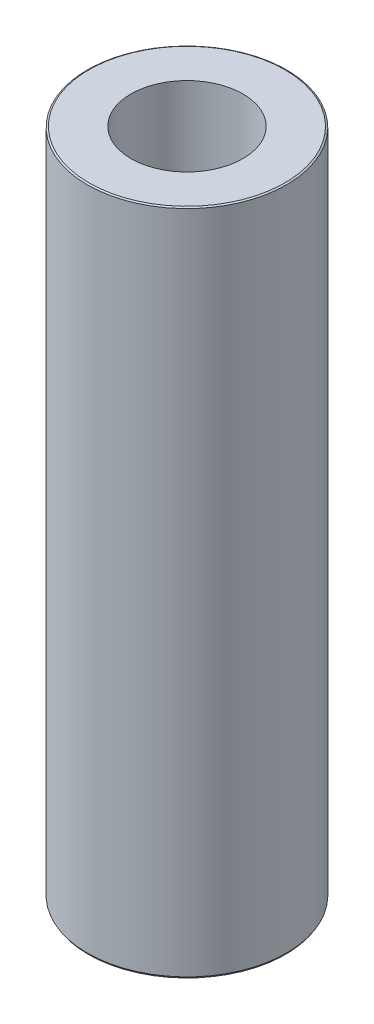
ISO-10303-21;
HEADER;
FILE_DESCRIPTION(('STEP AP214'),'2;1');
FILE_NAME('part.step','',(''),(''),'','','');
FILE_SCHEMA(('AUTOMOTIVE_DESIGN { 1 0 10303 214 1 1 1 1 }'));
ENDSEC;
DATA;
#1=APPLICATION_CONTEXT('core data for automotive mechanical design processes');
#2=APPLICATION_PROTOCOL_DEFINITION('international standard','automotive_design',2000,#1);
#3=PRODUCT_CONTEXT('',#1,'mechanical');
#4=PRODUCT('Part','Part','',(#3));
#5=PRODUCT_RELATED_PRODUCT_CATEGORY('part','',(#4));
#6=PRODUCT_DEFINITION_FORMATION('','',#4);
#7=PRODUCT_DEFINITION_CONTEXT('part definition',#1,'design');
#8=PRODUCT_DEFINITION('design','',#6,#7);
#9=PRODUCT_DEFINITION_SHAPE('','',#8);
#10=(LENGTH_UNIT() NAMED_UNIT(*) SI_UNIT(.MILLI.,.METRE.));
#11=(NAMED_UNIT(*) PLANE_ANGLE_UNIT() SI_UNIT($,.RADIAN.));
#12=(NAMED_UNIT(*) SI_UNIT($,.STERADIAN.) SOLID_ANGLE_UNIT());
#13=UNCERTAINTY_MEASURE_WITH_UNIT(LENGTH_MEASURE(1.E-05),#10,'distance_accuracy_value','');
#14=(GEOMETRIC_REPRESENTATION_CONTEXT(3) GLOBAL_UNCERTAINTY_ASSIGNED_CONTEXT((#13)) GLOBAL_UNIT_ASSIGNED_CONTEXT((#10,
#11,#12)) REPRESENTATION_CONTEXT('',''));
#15=CARTESIAN_POINT('',(0.,0.,0.));
#16=DIRECTION('',(0.,0.,1.));
#17=DIRECTION('',(1.,0.,0.));
#18=AXIS2_PLACEMENT_3D('',#15,#16,#17);
#19=CARTESIAN_POINT('',(0.,368.789732039845,0.));
#20=DIRECTION('',(0.,-1.,0.));
#21=DIRECTION('',(0.,0.,-1.));
#22=AXIS2_PLACEMENT_3D('',#19,#20,#21);
#23=CYLINDRICAL_SURFACE('',#22,55.);
#24=CARTESIAN_POINT('',(0.,368.290336708055,0.));
#25=DIRECTION('',(0.,1.,0.));
#26=DIRECTION('',(0.,0.,1.));
#27=AXIS2_PLACEMENT_3D('',#24,#25,#26);
#28=CIRCLE('',#27,55.);
#29=CARTESIAN_POINT('',(0.,368.290336708055,55.));
#30=VERTEX_POINT('',#29);
#31=EDGE_CURVE('E50',#30,#30,#28,.F.);
#32=ORIENTED_EDGE('',*,*,#31,.T.);
#33=EDGE_LOOP('',(#32));
#34=FACE_BOUND('',#33,.T.);
#35=CARTESIAN_POINT('',(0.,0.880697048363743,0.));
#36=DIRECTION('',(0.,1.,0.));
#37=DIRECTION('',(0.,0.,1.));
#38=AXIS2_PLACEMENT_3D('',#35,#36,#37);
#39=CIRCLE('',#38,55.);
#40=CARTESIAN_POINT('',(0.,0.880697048363743,55.));
#41=VERTEX_POINT('',#40);
#42=EDGE_CURVE('E51',#41,#41,#39,.T.);
#43=ORIENTED_EDGE('',*,*,#42,.T.);
#44=EDGE_LOOP('',(#43));
#45=FACE_BOUND('',#44,.T.);
#46=ADVANCED_FACE('F39',(#34,#45),#23,.T.);
#47=CARTESIAN_POINT('',(0.,368.789732039845,0.));
#48=DIRECTION('',(0.,1.,0.));
#49=DIRECTION('',(0.,0.,1.));
#50=AXIS2_PLACEMENT_3D('',#47,#48,#49);
#51=PLANE('',#50);
#52=CARTESIAN_POINT('',(0.,368.789732039845,0.));
#53=DIRECTION('',(0.,1.,0.));
#54=DIRECTION('',(0.,0.,1.));
#55=AXIS2_PLACEMENT_3D('',#52,#53,#54);
#56=CIRCLE('',#55,54.1193029516364);
#57=CARTESIAN_POINT('',(0.,368.789732039845,54.1193029516364));
#58=VERTEX_POINT('',#57);
#59=EDGE_CURVE('E54',#58,#58,#56,.T.);
#60=ORIENTED_EDGE('',*,*,#59,.T.);
#61=EDGE_LOOP('',(#60));
#62=FACE_BOUND('',#61,.T.);
#63=CARTESIAN_POINT('',(0.,368.789732039845,0.));
#64=DIRECTION('',(0.,1.,0.));
#65=DIRECTION('',(0.,0.,1.));
#66=AXIS2_PLACEMENT_3D('',#63,#64,#65);
#67=CIRCLE('',#66,30.9465049161381);
#68=CARTESIAN_POINT('',(0.,368.789732039845,30.9465049161381));
#69=VERTEX_POINT('',#68);
#70=EDGE_CURVE('E58',#69,#69,#67,.T.);
#71=ORIENTED_EDGE('',*,*,#70,.F.);
#72=EDGE_LOOP('',(#71));
#73=FACE_BOUND('',#72,.T.);
#74=ADVANCED_FACE('F69',(#62,#73),#51,.T.);
#75=CARTESIAN_POINT('',(0.,0.,0.));
#76=DIRECTION('',(0.,1.,0.));
#77=DIRECTION('',(0.,0.,1.));
#78=AXIS2_PLACEMENT_3D('',#75,#76,#77);
#79=PLANE('',#78);
#80=CARTESIAN_POINT('',(0.,0.,0.));
#81=DIRECTION('',(0.,1.,0.));
#82=DIRECTION('',(0.,0.,1.));
#83=AXIS2_PLACEMENT_3D('',#80,#81,#82);
#84=CIRCLE('',#83,54.50060466821);
#85=CARTESIAN_POINT('',(0.,0.,54.50060466821));
#86=VERTEX_POINT('',#85);
#87=EDGE_CURVE('E10',#86,#86,#84,.F.);
#88=ORIENTED_EDGE('',*,*,#87,.T.);
#89=EDGE_LOOP('',(#88));
#90=FACE_BOUND('',#89,.T.);
#91=CARTESIAN_POINT('',(0.,0.,0.));
#92=DIRECTION('',(0.,1.,0.));
#93=DIRECTION('',(0.,0.,1.));
#94=AXIS2_PLACEMENT_3D('',#91,#92,#93);
#95=CIRCLE('',#94,30.9465049161381);
#96=CARTESIAN_POINT('',(0.,0.,30.9465049161381));
#97=VERTEX_POINT('',#96);
#98=EDGE_CURVE('E63',#97,#97,#95,.T.);
#99=ORIENTED_EDGE('',*,*,#98,.T.);
#100=EDGE_LOOP('',(#99));
#101=FACE_BOUND('',#100,.T.);
#102=ADVANCED_FACE('F75',(#90,#101),#79,.F.);
#103=CARTESIAN_POINT('',(0.,368.789732039845,0.));
#104=DIRECTION('',(0.,-1.,0.));
#105=DIRECTION('',(0.,0.,-1.));
#106=AXIS2_PLACEMENT_3D('',#103,#104,#105);
#107=CYLINDRICAL_SURFACE('',#106,30.9465049161381);
#108=ORIENTED_EDGE('',*,*,#70,.T.);
#109=EDGE_LOOP('',(#108));
#110=FACE_BOUND('',#109,.T.);
#111=ORIENTED_EDGE('',*,*,#98,.F.);
#112=EDGE_LOOP('',(#111));
#113=FACE_BOUND('',#112,.T.);
#114=ADVANCED_FACE('F70',(#110,#113),#107,.F.);
#115=CARTESIAN_POINT('',(0.,368.789732039845,0.));
#116=DIRECTION('',(0.,-1.,0.));
#117=DIRECTION('',(0.,0.,-1.));
#118=AXIS2_PLACEMENT_3D('',#115,#116,#117);
#119=CONICAL_SURFACE('',#118,54.1193029516364,1.05496058344363);
#120=ORIENTED_EDGE('',*,*,#31,.F.);
#121=EDGE_LOOP('',(#120));
#122=FACE_BOUND('',#121,.T.);
#123=ORIENTED_EDGE('',*,*,#59,.F.);
#124=EDGE_LOOP('',(#123));
#125=FACE_BOUND('',#124,.T.);
#126=ADVANCED_FACE('F81',(#122,#125),#119,.T.);
#127=CARTESIAN_POINT('',(0.,0.880697048363743,0.));
#128=DIRECTION('',(0.,1.,0.));
#129=DIRECTION('',(0.,0.,1.));
#130=AXIS2_PLACEMENT_3D('',#127,#128,#129);
#131=CONICAL_SURFACE('',#130,55.,0.515835743351266);
#132=CARTESIAN_POINT('',(0.,0.,54.50060466821));
#133=CARTESIAN_POINT('',(0.,0.00917392758712239,54.5058067029161));
#134=CARTESIAN_POINT('',(0.,0.0183478551742446,54.5110087376223));
#135=CARTESIAN_POINT('',(0.,0.0366957103484891,54.5214128070346));
#136=CARTESIAN_POINT('',(0.,0.0458696379356113,54.5266148417407));
#137=CARTESIAN_POINT('',(0.,0.0642174931098564,54.537018911153));
#138=CARTESIAN_POINT('',(0.,0.0733914206969791,54.5422209458591));
#139=CARTESIAN_POINT('',(0.,0.0917392758712235,54.5526250152714));
#140=CARTESIAN_POINT('',(0.,0.100913203458345,54.5578270499776));
#141=CARTESIAN_POINT('',(0.,0.119261058632589,54.5682311193899));
#142=CARTESIAN_POINT('',(0.,0.128434986219712,54.573433154096));
#143=CARTESIAN_POINT('',(0.,0.146782841393957,54.5838372235083));
#144=CARTESIAN_POINT('',(0.,0.155956768981079,54.5890392582145));
#145=CARTESIAN_POINT('',(0.,0.174304624155324,54.5994433276267));
#146=CARTESIAN_POINT('',(0.,0.183478551742446,54.6046453623329));
#147=CARTESIAN_POINT('',(0.,0.201826406916691,54.6150494317452));
#148=CARTESIAN_POINT('',(0.,0.211000334503813,54.6202514664513));
#149=CARTESIAN_POINT('',(0.,0.229348189678058,54.6306555358636));
#150=CARTESIAN_POINT('',(0.,0.238522117265181,54.6358575705698));
#151=CARTESIAN_POINT('',(0.,0.256869972439425,54.6462616399821));
#152=CARTESIAN_POINT('',(0.,0.266043900026547,54.6514636746882));
#153=CARTESIAN_POINT('',(0.,0.284391755200791,54.6618677441005));
#154=CARTESIAN_POINT('',(0.,0.293565682787914,54.6670697788066));
#155=CARTESIAN_POINT('',(0.,0.311913537962159,54.6774738482189));
#156=CARTESIAN_POINT('',(0.,0.321087465549281,54.6826758829251));
#157=CARTESIAN_POINT('',(0.,0.339435320723526,54.6930799523374));
#158=CARTESIAN_POINT('',(0.,0.348609248310648,54.6982819870435));
#159=CARTESIAN_POINT('',(0.,0.366957103484893,54.7086860564558));
#160=CARTESIAN_POINT('',(0.,0.376131031072015,54.713888091162));
#161=CARTESIAN_POINT('',(0.,0.39447888624626,54.7242921605743));
#162=CARTESIAN_POINT('',(0.,0.403652813833382,54.7294941952804));
#163=CARTESIAN_POINT('',(0.,0.422000669007627,54.7398982646927));
#164=CARTESIAN_POINT('',(0.,0.43117459659475,54.7451002993988));
#165=CARTESIAN_POINT('',(0.,0.449522451768994,54.7555043688111));
#166=CARTESIAN_POINT('',(0.,0.458696379356116,54.7607064035173));
#167=CARTESIAN_POINT('',(0.,0.47704423453036,54.7711104729296));
#168=CARTESIAN_POINT('',(0.,0.486218162117483,54.7763125076357));
#169=CARTESIAN_POINT('',(0.,0.504566017291728,54.786716577048));
#170=CARTESIAN_POINT('',(0.,0.51373994487885,54.7919186117542));
#171=CARTESIAN_POINT('',(0.,0.532087800053095,54.8023226811664));
#172=CARTESIAN_POINT('',(0.,0.541261727640217,54.8075247158726));
#173=CARTESIAN_POINT('',(0.,0.559609582814462,54.8179287852849));
#174=CARTESIAN_POINT('',(0.,0.568783510401584,54.823130819991));
#175=CARTESIAN_POINT('',(0.,0.587131365575829,54.8335348894033));
#176=CARTESIAN_POINT('',(0.,0.596305293162952,54.8387369241095));
#177=CARTESIAN_POINT('',(0.,0.614653148337196,54.8491409935218));
#178=CARTESIAN_POINT('',(0.,0.623827075924318,54.8543430282279));
#179=CARTESIAN_POINT('',(0.,0.642174931098562,54.8647470976402));
#180=CARTESIAN_POINT('',(0.,0.651348858685685,54.8699491323463));
#181=CARTESIAN_POINT('',(0.,0.66969671385993,54.8803532017586));
#182=CARTESIAN_POINT('',(0.,0.678870641447052,54.8855552364648));
#183=CARTESIAN_POINT('',(0.,0.697218496621297,54.8959593058771));
#184=CARTESIAN_POINT('',(0.,0.706392424208419,54.9011613405832));
#185=CARTESIAN_POINT('',(0.,0.724740279382664,54.9115654099955));
#186=CARTESIAN_POINT('',(0.,0.733914206969786,54.9167674447017));
#187=CARTESIAN_POINT('',(0.,0.752262062144031,54.927171514114));
#188=CARTESIAN_POINT('',(0.,0.761435989731154,54.9323735488201));
#189=CARTESIAN_POINT('',(0.,0.779783844905398,54.9427776182324));
#190=CARTESIAN_POINT('',(0.,0.78895777249252,54.9479796529385));
#191=CARTESIAN_POINT('',(0.,0.807305627666764,54.9583837223508));
#192=CARTESIAN_POINT('',(0.,0.816479555253887,54.963585757057));
#193=CARTESIAN_POINT('',(0.,0.834827410428132,54.9739898264693));
#194=CARTESIAN_POINT('',(0.,0.844001338015254,54.9791918611754));
#195=CARTESIAN_POINT('',(0.,0.862349193189499,54.9895959305877));
#196=CARTESIAN_POINT('',(0.,0.871523120776621,54.9947979652939));
#197=CARTESIAN_POINT('',(0.,0.880697048363743,55.));
#198=B_SPLINE_CURVE_WITH_KNOTS('',3,(#132,#133,#134,#135,#136,#137,#138,#139,#140,#141,#142,
#143,#144,#145,#146,#147,#148,#149,#150,#151,#152,#153,#154,#155,#156,#157,#158,#159,#160,#161,
#162,#163,#164,#165,#166,#167,#168,#169,#170,#171,#172,#173,#174,#175,#176,#177,#178,#179,#180,
#181,#182,#183,#184,#185,#186,#187,#188,#189,#190,#191,#192,#193,#194,#195,#196,#197),
.UNSPECIFIED.,.F.,.F.,(4,2,2,2,2,2,2,2,2,2,2,2,2,2,2,2,2,2,2,2,2,2,2,2,2,2,2,2,2,2,2,2,4),(0.,
0.031638568427149,0.0632771368542979,0.0949157052814469,0.126554273708599,0.158192842135748,
0.189831410562897,0.221469978990046,0.253108547417195,0.284747115844344,0.316385684271496,
0.348024252698645,0.379662821125794,0.411301389552943,0.442939957980092,0.474578526407241,
0.50621709483439,0.537855663261543,0.569494231688692,0.60113280011584,0.632771368542989,
0.664409936970138,0.696048505397287,0.72768707382444,0.759325642251589,0.790964210678738,
0.822602779105887,0.854241347533035,0.885879915960184,0.917518484387337,0.949157052814486,
0.980795621241635,1.01243418966878),.UNSPECIFIED.);
#199=EDGE_CURVE('BSEAM45',#86,#41,#198,.T.);
#200=ORIENTED_EDGE('',*,*,#87,.F.);
#201=ORIENTED_EDGE('',*,*,#42,.F.);
#202=ORIENTED_EDGE('',*,*,#199,.T.);
#203=ORIENTED_EDGE('',*,*,#199,.F.);
#204=EDGE_LOOP('',(#200,#202,#201,#203));
#205=FACE_BOUND('',#204,.T.);
#206=ADVANCED_FACE('F45',(#205),#131,.T.);
#207=CLOSED_SHELL('',(#46,#74,#102,#114,#126,#206));
#208=MANIFOLD_SOLID_BREP('B2',#207);
#209=ADVANCED_BREP_SHAPE_REPRESENTATION('',(#18,#208),#14);
#210=SHAPE_DEFINITION_REPRESENTATION(#9,#209);
ENDSEC;
END-ISO-10303-21;
